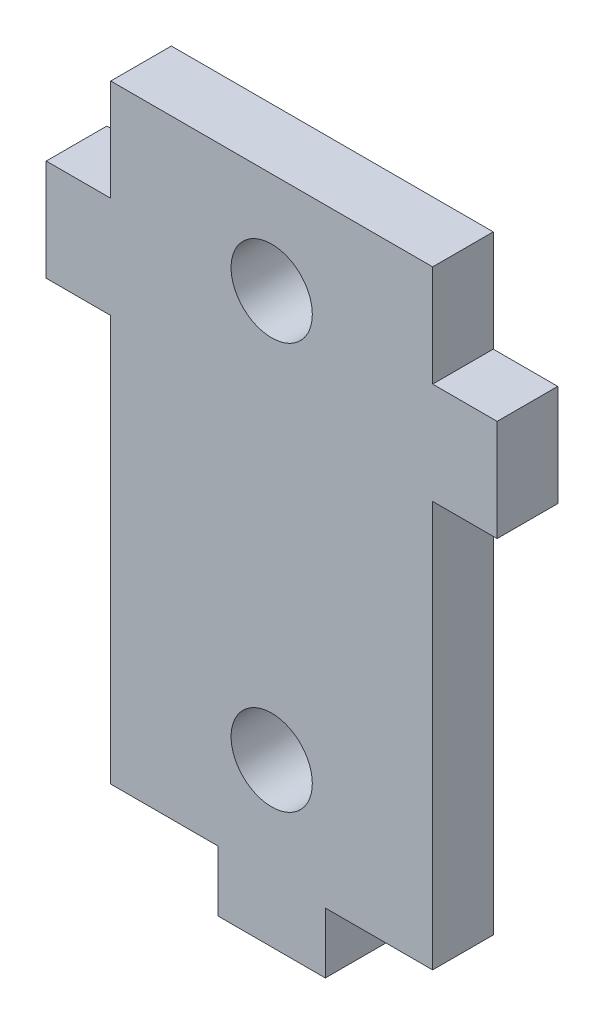
ISO-10303-21;
HEADER;
FILE_DESCRIPTION(('STEP AP214'),'2;1');
FILE_NAME('part.step','',(''),(''),'','','');
FILE_SCHEMA(('AUTOMOTIVE_DESIGN { 1 0 10303 214 1 1 1 1 }'));
ENDSEC;
DATA;
#1=APPLICATION_CONTEXT('core data for automotive mechanical design processes');
#2=APPLICATION_PROTOCOL_DEFINITION('international standard','automotive_design',2000,#1);
#3=PRODUCT_CONTEXT('',#1,'mechanical');
#4=PRODUCT('Part','Part','',(#3));
#5=PRODUCT_RELATED_PRODUCT_CATEGORY('part','',(#4));
#6=PRODUCT_DEFINITION_FORMATION('','',#4);
#7=PRODUCT_DEFINITION_CONTEXT('part definition',#1,'design');
#8=PRODUCT_DEFINITION('design','',#6,#7);
#9=PRODUCT_DEFINITION_SHAPE('','',#8);
#10=(LENGTH_UNIT() NAMED_UNIT(*) SI_UNIT(.MILLI.,.METRE.));
#11=(NAMED_UNIT(*) PLANE_ANGLE_UNIT() SI_UNIT($,.RADIAN.));
#12=(NAMED_UNIT(*) SI_UNIT($,.STERADIAN.) SOLID_ANGLE_UNIT());
#13=UNCERTAINTY_MEASURE_WITH_UNIT(LENGTH_MEASURE(1.E-05),#10,'distance_accuracy_value','');
#14=(GEOMETRIC_REPRESENTATION_CONTEXT(3) GLOBAL_UNCERTAINTY_ASSIGNED_CONTEXT((#13)) GLOBAL_UNIT_ASSIGNED_CONTEXT((#10,
#11,#12)) REPRESENTATION_CONTEXT('',''));
#15=CARTESIAN_POINT('',(0.,0.,0.));
#16=DIRECTION('',(0.,0.,1.));
#17=DIRECTION('',(1.,0.,0.));
#18=AXIS2_PLACEMENT_3D('',#15,#16,#17);
#19=CARTESIAN_POINT('',(-2.21666666666667,49.9590392592217,5.969));
#20=DIRECTION('',(0.,1.,0.));
#21=DIRECTION('',(0.,0.,1.));
#22=AXIS2_PLACEMENT_3D('',#19,#20,#21);
#23=PLANE('',#22);
#24=DIRECTION('',(1.,0.,0.));
#25=VECTOR('',#24,1.);
#26=CARTESIAN_POINT('',(-2.21666666666667,49.9590392592217,5.969));
#27=LINE('',#26,#25);
#28=CARTESIAN_POINT('',(-16.9166666666667,49.9590392592217,5.969));
#29=VERTEX_POINT('',#28);
#30=CARTESIAN_POINT('',(-10.5666666666667,49.9590392592217,5.969));
#31=VERTEX_POINT('',#30);
#32=EDGE_CURVE('E163',#29,#31,#27,.T.);
#33=ORIENTED_EDGE('',*,*,#32,.T.);
#34=DIRECTION('',(0.,0.,1.));
#35=VECTOR('',#34,1.);
#36=CARTESIAN_POINT('',(-10.5666666666667,49.9590392592217,-40.8221425028136));
#37=LINE('',#36,#35);
#38=CARTESIAN_POINT('',(-10.5666666666667,49.9590392592217,0.));
#39=VERTEX_POINT('',#38);
#40=EDGE_CURVE('E150',#39,#31,#37,.T.);
#41=ORIENTED_EDGE('',*,*,#40,.F.);
#42=DIRECTION('',(1.,0.,0.));
#43=VECTOR('',#42,1.);
#44=CARTESIAN_POINT('',(-2.21666666666667,49.9590392592217,0.));
#45=LINE('',#44,#43);
#46=CARTESIAN_POINT('',(-16.9166666666667,49.9590392592217,0.));
#47=VERTEX_POINT('',#46);
#48=EDGE_CURVE('E161',#47,#39,#45,.T.);
#49=ORIENTED_EDGE('',*,*,#48,.F.);
#50=DIRECTION('',(0.,0.,-1.));
#51=VECTOR('',#50,1.);
#52=CARTESIAN_POINT('',(-16.9166666666667,49.9590392592217,5.969));
#53=LINE('',#52,#51);
#54=EDGE_CURVE('E178',#29,#47,#53,.T.);
#55=ORIENTED_EDGE('',*,*,#54,.F.);
#56=EDGE_LOOP('',(#33,#41,#49,#55));
#57=FACE_BOUND('',#56,.T.);
#58=ADVANCED_FACE('F34',(#57),#23,.T.);
#59=CARTESIAN_POINT('',(-2.21666666666667,39.9590392592217,5.969));
#60=DIRECTION('',(0.,-1.,0.));
#61=DIRECTION('',(0.,0.,-1.));
#62=AXIS2_PLACEMENT_3D('',#59,#60,#61);
#63=PLANE('',#62);
#64=DIRECTION('',(-1.,0.,0.));
#65=VECTOR('',#64,1.);
#66=CARTESIAN_POINT('',(-2.21666666666667,39.9590392592217,0.));
#67=LINE('',#66,#65);
#68=CARTESIAN_POINT('',(-10.5666666666667,39.9590392592217,0.));
#69=VERTEX_POINT('',#68);
#70=CARTESIAN_POINT('',(-16.9166666666667,39.9590392592217,0.));
#71=VERTEX_POINT('',#70);
#72=EDGE_CURVE('E174',#69,#71,#67,.T.);
#73=ORIENTED_EDGE('',*,*,#72,.F.);
#74=DIRECTION('',(0.,0.,1.));
#75=VECTOR('',#74,1.);
#76=CARTESIAN_POINT('',(-10.5666666666667,39.9590392592217,-40.8221425028136));
#77=LINE('',#76,#75);
#78=CARTESIAN_POINT('',(-10.5666666666667,39.9590392592217,5.969));
#79=VERTEX_POINT('',#78);
#80=EDGE_CURVE('E271',#69,#79,#77,.T.);
#81=ORIENTED_EDGE('',*,*,#80,.T.);
#82=DIRECTION('',(-1.,0.,0.));
#83=VECTOR('',#82,1.);
#84=CARTESIAN_POINT('',(-2.21666666666667,39.9590392592217,5.969));
#85=LINE('',#84,#83);
#86=CARTESIAN_POINT('',(-16.9166666666667,39.9590392592217,5.969));
#87=VERTEX_POINT('',#86);
#88=EDGE_CURVE('E170',#79,#87,#85,.T.);
#89=ORIENTED_EDGE('',*,*,#88,.T.);
#90=DIRECTION('',(0.,0.,-1.));
#91=VECTOR('',#90,1.);
#92=CARTESIAN_POINT('',(-16.9166666666667,39.9590392592217,5.969));
#93=LINE('',#92,#91);
#94=EDGE_CURVE('E181',#87,#71,#93,.T.);
#95=ORIENTED_EDGE('',*,*,#94,.T.);
#96=EDGE_LOOP('',(#73,#81,#89,#95));
#97=FACE_BOUND('',#96,.T.);
#98=ADVANCED_FACE('F314',(#97),#63,.T.);
#99=CARTESIAN_POINT('',(12.7833333333333,39.9590392592217,5.969));
#100=DIRECTION('',(0.,-1.,0.));
#101=DIRECTION('',(0.,0.,-1.));
#102=AXIS2_PLACEMENT_3D('',#99,#100,#101);
#103=PLANE('',#102);
#104=DIRECTION('',(-1.,0.,0.));
#105=VECTOR('',#104,1.);
#106=CARTESIAN_POINT('',(12.7833333333333,39.9590392592217,5.969));
#107=LINE('',#106,#105);
#108=CARTESIAN_POINT('',(27.4833333333333,39.9590392592217,5.969));
#109=VERTEX_POINT('',#108);
#110=CARTESIAN_POINT('',(21.1333333333333,39.9590392592217,5.969));
#111=VERTEX_POINT('',#110);
#112=EDGE_CURVE('E297',#109,#111,#107,.T.);
#113=ORIENTED_EDGE('',*,*,#112,.T.);
#114=DIRECTION('',(0.,0.,1.));
#115=VECTOR('',#114,1.);
#116=CARTESIAN_POINT('',(21.1333333333333,39.9590392592217,-40.8221425028136));
#117=LINE('',#116,#115);
#118=CARTESIAN_POINT('',(21.1333333333333,39.9590392592217,0.));
#119=VERTEX_POINT('',#118);
#120=EDGE_CURVE('E276',#119,#111,#117,.T.);
#121=ORIENTED_EDGE('',*,*,#120,.F.);
#122=DIRECTION('',(-1.,0.,0.));
#123=VECTOR('',#122,1.);
#124=CARTESIAN_POINT('',(12.7833333333333,39.9590392592217,0.));
#125=LINE('',#124,#123);
#126=CARTESIAN_POINT('',(27.4833333333333,39.9590392592217,0.));
#127=VERTEX_POINT('',#126);
#128=EDGE_CURVE('E294',#127,#119,#125,.T.);
#129=ORIENTED_EDGE('',*,*,#128,.F.);
#130=DIRECTION('',(0.,0.,-1.));
#131=VECTOR('',#130,1.);
#132=CARTESIAN_POINT('',(27.4833333333333,39.9590392592217,5.969));
#133=LINE('',#132,#131);
#134=EDGE_CURVE('E305',#109,#127,#133,.T.);
#135=ORIENTED_EDGE('',*,*,#134,.F.);
#136=EDGE_LOOP('',(#113,#121,#129,#135));
#137=FACE_BOUND('',#136,.T.);
#138=ADVANCED_FACE('F334',(#137),#103,.T.);
#139=CARTESIAN_POINT('',(12.7833333333333,49.9590392592217,5.969));
#140=DIRECTION('',(0.,1.,0.));
#141=DIRECTION('',(0.,0.,1.));
#142=AXIS2_PLACEMENT_3D('',#139,#140,#141);
#143=PLANE('',#142);
#144=DIRECTION('',(1.,0.,0.));
#145=VECTOR('',#144,1.);
#146=CARTESIAN_POINT('',(12.7833333333333,49.9590392592217,0.));
#147=LINE('',#146,#145);
#148=CARTESIAN_POINT('',(21.1333333333333,49.9590392592217,0.));
#149=VERTEX_POINT('',#148);
#150=CARTESIAN_POINT('',(27.4833333333333,49.9590392592217,0.));
#151=VERTEX_POINT('',#150);
#152=EDGE_CURVE('E286',#149,#151,#147,.T.);
#153=ORIENTED_EDGE('',*,*,#152,.F.);
#154=DIRECTION('',(0.,0.,1.));
#155=VECTOR('',#154,1.);
#156=CARTESIAN_POINT('',(21.1333333333333,49.9590392592217,-40.8221425028136));
#157=LINE('',#156,#155);
#158=CARTESIAN_POINT('',(21.1333333333333,49.9590392592217,5.969));
#159=VERTEX_POINT('',#158);
#160=EDGE_CURVE('E284',#149,#159,#157,.T.);
#161=ORIENTED_EDGE('',*,*,#160,.T.);
#162=DIRECTION('',(1.,0.,0.));
#163=VECTOR('',#162,1.);
#164=CARTESIAN_POINT('',(12.7833333333333,49.9590392592217,5.969));
#165=LINE('',#164,#163);
#166=CARTESIAN_POINT('',(27.4833333333333,49.9590392592217,5.969));
#167=VERTEX_POINT('',#166);
#168=EDGE_CURVE('E291',#159,#167,#165,.T.);
#169=ORIENTED_EDGE('',*,*,#168,.T.);
#170=DIRECTION('',(0.,0.,-1.));
#171=VECTOR('',#170,1.);
#172=CARTESIAN_POINT('',(27.4833333333333,49.9590392592217,5.969));
#173=LINE('',#172,#171);
#174=EDGE_CURVE('E299',#167,#151,#173,.T.);
#175=ORIENTED_EDGE('',*,*,#174,.T.);
#176=EDGE_LOOP('',(#153,#161,#169,#175));
#177=FACE_BOUND('',#176,.T.);
#178=ADVANCED_FACE('F327',(#177),#143,.T.);
#179=CARTESIAN_POINT('',(0.,0.,5.969));
#180=DIRECTION('',(0.,0.,-1.));
#181=DIRECTION('',(-1.,0.,0.));
#182=AXIS2_PLACEMENT_3D('',#179,#180,#181);
#183=PLANE('',#182);
#184=DIRECTION('',(0.,1.,0.));
#185=VECTOR('',#184,1.);
#186=CARTESIAN_POINT('',(-10.5666666666667,0.,5.969));
#187=LINE('',#186,#185);
#188=CARTESIAN_POINT('',(-10.5666666666667,0.,5.969));
#189=VERTEX_POINT('',#188);
#190=EDGE_CURVE('E155',#189,#79,#187,.T.);
#191=ORIENTED_EDGE('',*,*,#190,.F.);
#192=DIRECTION('',(1.,0.,0.));
#193=VECTOR('',#192,1.);
#194=CARTESIAN_POINT('',(-10.5666666666667,0.,5.969));
#195=LINE('',#194,#193);
#196=CARTESIAN_POINT('',(0.,0.,5.969));
#197=VERTEX_POINT('',#196);
#198=EDGE_CURVE('E209',#189,#197,#195,.T.);
#199=ORIENTED_EDGE('',*,*,#198,.T.);
#200=DIRECTION('',(0.,-1.,0.));
#201=VECTOR('',#200,1.);
#202=CARTESIAN_POINT('',(0.,-5.969,5.969));
#203=LINE('',#202,#201);
#204=CARTESIAN_POINT('',(0.,-5.969,5.969));
#205=VERTEX_POINT('',#204);
#206=EDGE_CURVE('E196',#197,#205,#203,.T.);
#207=ORIENTED_EDGE('',*,*,#206,.T.);
#208=DIRECTION('',(1.,0.,0.));
#209=VECTOR('',#208,1.);
#210=CARTESIAN_POINT('',(10.5666666666667,-5.969,5.969));
#211=LINE('',#210,#209);
#212=CARTESIAN_POINT('',(10.5666666666667,-5.969,5.969));
#213=VERTEX_POINT('',#212);
#214=EDGE_CURVE('E199',#205,#213,#211,.T.);
#215=ORIENTED_EDGE('',*,*,#214,.T.);
#216=DIRECTION('',(0.,1.,0.));
#217=VECTOR('',#216,1.);
#218=CARTESIAN_POINT('',(10.5666666666667,0.,5.969));
#219=LINE('',#218,#217);
#220=CARTESIAN_POINT('',(10.5666666666667,0.,5.969));
#221=VERTEX_POINT('',#220);
#222=EDGE_CURVE('E202',#213,#221,#219,.T.);
#223=ORIENTED_EDGE('',*,*,#222,.T.);
#224=DIRECTION('',(1.,0.,0.));
#225=VECTOR('',#224,1.);
#226=CARTESIAN_POINT('',(21.1333333333333,0.,5.969));
#227=LINE('',#226,#225);
#228=CARTESIAN_POINT('',(21.1333333333333,0.,5.969));
#229=VERTEX_POINT('',#228);
#230=EDGE_CURVE('E204',#221,#229,#227,.T.);
#231=ORIENTED_EDGE('',*,*,#230,.T.);
#232=DIRECTION('',(0.,-1.,0.));
#233=VECTOR('',#232,1.);
#234=CARTESIAN_POINT('',(21.1333333333333,0.,5.969));
#235=LINE('',#234,#233);
#236=EDGE_CURVE('E256',#111,#229,#235,.T.);
#237=ORIENTED_EDGE('',*,*,#236,.F.);
#238=ORIENTED_EDGE('',*,*,#112,.F.);
#239=DIRECTION('',(0.,-1.,0.));
#240=VECTOR('',#239,1.);
#241=CARTESIAN_POINT('',(27.4833333333333,49.9590392592217,5.969));
#242=LINE('',#241,#240);
#243=EDGE_CURVE('E293',#167,#109,#242,.T.);
#244=ORIENTED_EDGE('',*,*,#243,.F.);
#245=ORIENTED_EDGE('',*,*,#168,.F.);
#246=DIRECTION('',(0.,-1.,0.));
#247=VECTOR('',#246,1.);
#248=CARTESIAN_POINT('',(21.1333333333333,0.,5.969));
#249=LINE('',#248,#247);
#250=CARTESIAN_POINT('',(21.1333333333333,59.9590392592217,5.969));
#251=VERTEX_POINT('',#250);
#252=EDGE_CURVE('E282',#251,#159,#249,.T.);
#253=ORIENTED_EDGE('',*,*,#252,.F.);
#254=DIRECTION('',(-1.,0.,0.));
#255=VECTOR('',#254,1.);
#256=CARTESIAN_POINT('',(-2.21666666666667,59.9590392592217,5.969));
#257=LINE('',#256,#255);
#258=CARTESIAN_POINT('',(-10.5666666666667,59.9590392592217,5.969));
#259=VERTEX_POINT('',#258);
#260=EDGE_CURVE('E207',#251,#259,#257,.T.);
#261=ORIENTED_EDGE('',*,*,#260,.T.);
#262=DIRECTION('',(0.,1.,0.));
#263=VECTOR('',#262,1.);
#264=CARTESIAN_POINT('',(-10.5666666666667,0.,5.969));
#265=LINE('',#264,#263);
#266=EDGE_CURVE('E156',#31,#259,#265,.T.);
#267=ORIENTED_EDGE('',*,*,#266,.F.);
#268=ORIENTED_EDGE('',*,*,#32,.F.);
#269=DIRECTION('',(0.,1.,0.));
#270=VECTOR('',#269,1.);
#271=CARTESIAN_POINT('',(-16.9166666666667,49.9590392592217,5.969));
#272=LINE('',#271,#270);
#273=EDGE_CURVE('E172',#87,#29,#272,.T.);
#274=ORIENTED_EDGE('',*,*,#273,.F.);
#275=ORIENTED_EDGE('',*,*,#88,.F.);
#276=EDGE_LOOP('',(#191,#199,#207,#215,#223,#231,#237,#238,#244,#245,#253,#261,#267,#268,#274,#275));
#277=FACE_BOUND('',#276,.T.);
#278=CARTESIAN_POINT('',(5.28333333333333,49.9795196296108,5.969));
#279=DIRECTION('',(0.,0.,1.));
#280=DIRECTION('',(1.,0.,0.));
#281=AXIS2_PLACEMENT_3D('',#278,#279,#280);
#282=CIRCLE('',#281,4.);
#283=CARTESIAN_POINT('',(9.28333333333334,49.9795196296108,5.969));
#284=VERTEX_POINT('',#283);
#285=EDGE_CURVE('E190',#284,#284,#282,.T.);
#286=ORIENTED_EDGE('',*,*,#285,.F.);
#287=EDGE_LOOP('',(#286));
#288=FACE_BOUND('',#287,.T.);
#289=CARTESIAN_POINT('',(5.28333333333333,9.97951962961084,5.969));
#290=DIRECTION('',(0.,0.,1.));
#291=DIRECTION('',(1.,0.,0.));
#292=AXIS2_PLACEMENT_3D('',#289,#290,#291);
#293=CIRCLE('',#292,4.);
#294=CARTESIAN_POINT('',(9.28333333333333,9.97951962961084,5.969));
#295=VERTEX_POINT('',#294);
#296=EDGE_CURVE('E184',#295,#295,#293,.T.);
#297=ORIENTED_EDGE('',*,*,#296,.F.);
#298=EDGE_LOOP('',(#297));
#299=FACE_BOUND('',#298,.T.);
#300=ADVANCED_FACE('F253',(#277,#288,#299),#183,.F.);
#301=CARTESIAN_POINT('',(0.,0.,0.));
#302=DIRECTION('',(0.,0.,-1.));
#303=DIRECTION('',(-1.,0.,0.));
#304=AXIS2_PLACEMENT_3D('',#301,#302,#303);
#305=PLANE('',#304);
#306=DIRECTION('',(1.,0.,0.));
#307=VECTOR('',#306,1.);
#308=CARTESIAN_POINT('',(-10.5666666666667,0.,0.));
#309=LINE('',#308,#307);
#310=CARTESIAN_POINT('',(-10.5666666666667,0.,0.));
#311=VERTEX_POINT('',#310);
#312=CARTESIAN_POINT('',(0.,0.,0.));
#313=VERTEX_POINT('',#312);
#314=EDGE_CURVE('E200',#311,#313,#309,.T.);
#315=ORIENTED_EDGE('',*,*,#314,.F.);
#316=DIRECTION('',(0.,1.,0.));
#317=VECTOR('',#316,1.);
#318=CARTESIAN_POINT('',(-10.5666666666667,0.,0.));
#319=LINE('',#318,#317);
#320=EDGE_CURVE('E49',#311,#69,#319,.T.);
#321=ORIENTED_EDGE('',*,*,#320,.T.);
#322=ORIENTED_EDGE('',*,*,#72,.T.);
#323=DIRECTION('',(0.,1.,0.));
#324=VECTOR('',#323,1.);
#325=CARTESIAN_POINT('',(-16.9166666666667,49.9590392592217,0.));
#326=LINE('',#325,#324);
#327=EDGE_CURVE('E169',#71,#47,#326,.T.);
#328=ORIENTED_EDGE('',*,*,#327,.T.);
#329=ORIENTED_EDGE('',*,*,#48,.T.);
#330=DIRECTION('',(0.,1.,0.));
#331=VECTOR('',#330,1.);
#332=CARTESIAN_POINT('',(-10.5666666666667,0.,0.));
#333=LINE('',#332,#331);
#334=CARTESIAN_POINT('',(-10.5666666666667,59.9590392592217,0.));
#335=VERTEX_POINT('',#334);
#336=EDGE_CURVE('E146',#39,#335,#333,.T.);
#337=ORIENTED_EDGE('',*,*,#336,.T.);
#338=DIRECTION('',(-1.,0.,0.));
#339=VECTOR('',#338,1.);
#340=CARTESIAN_POINT('',(-2.21666666666667,59.9590392592217,0.));
#341=LINE('',#340,#339);
#342=CARTESIAN_POINT('',(21.1333333333333,59.9590392592217,0.));
#343=VERTEX_POINT('',#342);
#344=EDGE_CURVE('E221',#343,#335,#341,.T.);
#345=ORIENTED_EDGE('',*,*,#344,.F.);
#346=DIRECTION('',(0.,-1.,0.));
#347=VECTOR('',#346,1.);
#348=CARTESIAN_POINT('',(21.1333333333333,0.,0.));
#349=LINE('',#348,#347);
#350=EDGE_CURVE('E56',#343,#149,#349,.T.);
#351=ORIENTED_EDGE('',*,*,#350,.T.);
#352=ORIENTED_EDGE('',*,*,#152,.T.);
#353=DIRECTION('',(0.,-1.,0.));
#354=VECTOR('',#353,1.);
#355=CARTESIAN_POINT('',(27.4833333333333,49.9590392592217,0.));
#356=LINE('',#355,#354);
#357=EDGE_CURVE('E301',#151,#127,#356,.T.);
#358=ORIENTED_EDGE('',*,*,#357,.T.);
#359=ORIENTED_EDGE('',*,*,#128,.T.);
#360=DIRECTION('',(0.,-1.,0.));
#361=VECTOR('',#360,1.);
#362=CARTESIAN_POINT('',(21.1333333333333,0.,0.));
#363=LINE('',#362,#361);
#364=CARTESIAN_POINT('',(21.1333333333333,0.,0.));
#365=VERTEX_POINT('',#364);
#366=EDGE_CURVE('E245',#119,#365,#363,.T.);
#367=ORIENTED_EDGE('',*,*,#366,.T.);
#368=DIRECTION('',(1.,0.,0.));
#369=VECTOR('',#368,1.);
#370=CARTESIAN_POINT('',(21.1333333333333,0.,0.));
#371=LINE('',#370,#369);
#372=CARTESIAN_POINT('',(10.5666666666667,0.,0.));
#373=VERTEX_POINT('',#372);
#374=EDGE_CURVE('E218',#373,#365,#371,.T.);
#375=ORIENTED_EDGE('',*,*,#374,.F.);
#376=DIRECTION('',(0.,1.,0.));
#377=VECTOR('',#376,1.);
#378=CARTESIAN_POINT('',(10.5666666666667,0.,0.));
#379=LINE('',#378,#377);
#380=CARTESIAN_POINT('',(10.5666666666667,-5.969,0.));
#381=VERTEX_POINT('',#380);
#382=EDGE_CURVE('E216',#381,#373,#379,.T.);
#383=ORIENTED_EDGE('',*,*,#382,.F.);
#384=DIRECTION('',(1.,0.,0.));
#385=VECTOR('',#384,1.);
#386=CARTESIAN_POINT('',(10.5666666666667,-5.969,0.));
#387=LINE('',#386,#385);
#388=CARTESIAN_POINT('',(0.,-5.969,0.));
#389=VERTEX_POINT('',#388);
#390=EDGE_CURVE('E214',#389,#381,#387,.T.);
#391=ORIENTED_EDGE('',*,*,#390,.F.);
#392=DIRECTION('',(0.,-1.,0.));
#393=VECTOR('',#392,1.);
#394=CARTESIAN_POINT('',(0.,-5.969,0.));
#395=LINE('',#394,#393);
#396=EDGE_CURVE('E193',#313,#389,#395,.T.);
#397=ORIENTED_EDGE('',*,*,#396,.F.);
#398=EDGE_LOOP('',(#315,#321,#322,#328,#329,#337,#345,#351,#352,#358,#359,#367,#375,#383,#391,#397));
#399=FACE_BOUND('',#398,.T.);
#400=CARTESIAN_POINT('',(5.28333333333333,49.9795196296108,0.));
#401=DIRECTION('',(0.,0.,1.));
#402=DIRECTION('',(1.,0.,0.));
#403=AXIS2_PLACEMENT_3D('',#400,#401,#402);
#404=CIRCLE('',#403,4.);
#405=CARTESIAN_POINT('',(9.28333333333334,49.9795196296108,0.));
#406=VERTEX_POINT('',#405);
#407=EDGE_CURVE('E187',#406,#406,#404,.T.);
#408=ORIENTED_EDGE('',*,*,#407,.T.);
#409=EDGE_LOOP('',(#408));
#410=FACE_BOUND('',#409,.T.);
#411=CARTESIAN_POINT('',(5.28333333333333,9.97951962961084,0.));
#412=DIRECTION('',(0.,0.,1.));
#413=DIRECTION('',(1.,0.,0.));
#414=AXIS2_PLACEMENT_3D('',#411,#412,#413);
#415=CIRCLE('',#414,4.);
#416=CARTESIAN_POINT('',(9.28333333333333,9.97951962961084,0.));
#417=VERTEX_POINT('',#416);
#418=EDGE_CURVE('E180',#417,#417,#415,.T.);
#419=ORIENTED_EDGE('',*,*,#418,.T.);
#420=EDGE_LOOP('',(#419));
#421=FACE_BOUND('',#420,.T.);
#422=ADVANCED_FACE('F166',(#399,#410,#421),#305,.T.);
#423=CARTESIAN_POINT('',(0.,-5.969,5.969));
#424=DIRECTION('',(1.,0.,0.));
#425=DIRECTION('',(0.,0.,-1.));
#426=AXIS2_PLACEMENT_3D('',#423,#424,#425);
#427=PLANE('',#426);
#428=ORIENTED_EDGE('',*,*,#396,.T.);
#429=DIRECTION('',(0.,0.,-1.));
#430=VECTOR('',#429,1.);
#431=CARTESIAN_POINT('',(0.,-5.969,5.969));
#432=LINE('',#431,#430);
#433=EDGE_CURVE('E11',#205,#389,#432,.T.);
#434=ORIENTED_EDGE('',*,*,#433,.F.);
#435=ORIENTED_EDGE('',*,*,#206,.F.);
#436=DIRECTION('',(0.,0.,-1.));
#437=VECTOR('',#436,1.);
#438=CARTESIAN_POINT('',(0.,0.,5.969));
#439=LINE('',#438,#437);
#440=EDGE_CURVE('E211',#197,#313,#439,.T.);
#441=ORIENTED_EDGE('',*,*,#440,.T.);
#442=EDGE_LOOP('',(#428,#434,#435,#441));
#443=FACE_BOUND('',#442,.T.);
#444=ADVANCED_FACE('F36',(#443),#427,.F.);
#445=CARTESIAN_POINT('',(10.5666666666667,-5.969,5.969));
#446=DIRECTION('',(0.,1.,0.));
#447=DIRECTION('',(0.,0.,1.));
#448=AXIS2_PLACEMENT_3D('',#445,#446,#447);
#449=PLANE('',#448);
#450=ORIENTED_EDGE('',*,*,#390,.T.);
#451=DIRECTION('',(0.,0.,-1.));
#452=VECTOR('',#451,1.);
#453=CARTESIAN_POINT('',(10.5666666666667,-5.969,5.969));
#454=LINE('',#453,#452);
#455=EDGE_CURVE('E42',#213,#381,#454,.T.);
#456=ORIENTED_EDGE('',*,*,#455,.F.);
#457=ORIENTED_EDGE('',*,*,#214,.F.);
#458=ORIENTED_EDGE('',*,*,#433,.T.);
#459=EDGE_LOOP('',(#450,#456,#457,#458));
#460=FACE_BOUND('',#459,.T.);
#461=ADVANCED_FACE('F260',(#460),#449,.F.);
#462=CARTESIAN_POINT('',(10.5666666666667,0.,5.969));
#463=DIRECTION('',(-1.,0.,0.));
#464=DIRECTION('',(0.,0.,1.));
#465=AXIS2_PLACEMENT_3D('',#462,#463,#464);
#466=PLANE('',#465);
#467=ORIENTED_EDGE('',*,*,#382,.T.);
#468=DIRECTION('',(0.,0.,-1.));
#469=VECTOR('',#468,1.);
#470=CARTESIAN_POINT('',(10.5666666666667,0.,5.969));
#471=LINE('',#470,#469);
#472=EDGE_CURVE('E231',#221,#373,#471,.T.);
#473=ORIENTED_EDGE('',*,*,#472,.F.);
#474=ORIENTED_EDGE('',*,*,#222,.F.);
#475=ORIENTED_EDGE('',*,*,#455,.T.);
#476=EDGE_LOOP('',(#467,#473,#474,#475));
#477=FACE_BOUND('',#476,.T.);
#478=ADVANCED_FACE('F238',(#477),#466,.F.);
#479=CARTESIAN_POINT('',(21.1333333333333,0.,5.969));
#480=DIRECTION('',(0.,1.,0.));
#481=DIRECTION('',(0.,0.,1.));
#482=AXIS2_PLACEMENT_3D('',#479,#480,#481);
#483=PLANE('',#482);
#484=ORIENTED_EDGE('',*,*,#374,.T.);
#485=DIRECTION('',(0.,0.,-1.));
#486=VECTOR('',#485,1.);
#487=CARTESIAN_POINT('',(21.1333333333333,0.,5.969));
#488=LINE('',#487,#486);
#489=EDGE_CURVE('E229',#229,#365,#488,.T.);
#490=ORIENTED_EDGE('',*,*,#489,.F.);
#491=ORIENTED_EDGE('',*,*,#230,.F.);
#492=ORIENTED_EDGE('',*,*,#472,.T.);
#493=EDGE_LOOP('',(#484,#490,#491,#492));
#494=FACE_BOUND('',#493,.T.);
#495=ADVANCED_FACE('F248',(#494),#483,.F.);
#496=CARTESIAN_POINT('',(-2.21666666666667,59.9590392592217,5.969));
#497=DIRECTION('',(0.,-1.,0.));
#498=DIRECTION('',(0.,0.,-1.));
#499=AXIS2_PLACEMENT_3D('',#496,#497,#498);
#500=PLANE('',#499);
#501=ORIENTED_EDGE('',*,*,#344,.T.);
#502=DIRECTION('',(0.,0.,1.));
#503=VECTOR('',#502,1.);
#504=CARTESIAN_POINT('',(-10.5666666666667,59.9590392592217,-40.8221425028136));
#505=LINE('',#504,#503);
#506=EDGE_CURVE('E153',#335,#259,#505,.T.);
#507=ORIENTED_EDGE('',*,*,#506,.T.);
#508=ORIENTED_EDGE('',*,*,#260,.F.);
#509=DIRECTION('',(0.,0.,1.));
#510=VECTOR('',#509,1.);
#511=CARTESIAN_POINT('',(21.1333333333333,59.9590392592217,-40.8221425028136));
#512=LINE('',#511,#510);
#513=EDGE_CURVE('E280',#343,#251,#512,.T.);
#514=ORIENTED_EDGE('',*,*,#513,.F.);
#515=EDGE_LOOP('',(#501,#507,#508,#514));
#516=FACE_BOUND('',#515,.T.);
#517=ADVANCED_FACE('F322',(#516),#500,.F.);
#518=CARTESIAN_POINT('',(-10.5666666666667,0.,5.969));
#519=DIRECTION('',(0.,1.,0.));
#520=DIRECTION('',(0.,0.,1.));
#521=AXIS2_PLACEMENT_3D('',#518,#519,#520);
#522=PLANE('',#521);
#523=ORIENTED_EDGE('',*,*,#314,.T.);
#524=ORIENTED_EDGE('',*,*,#440,.F.);
#525=ORIENTED_EDGE('',*,*,#198,.F.);
#526=DIRECTION('',(0.,0.,-1.));
#527=VECTOR('',#526,1.);
#528=CARTESIAN_POINT('',(-10.5666666666667,0.,5.969));
#529=LINE('',#528,#527);
#530=EDGE_CURVE('E226',#189,#311,#529,.T.);
#531=ORIENTED_EDGE('',*,*,#530,.T.);
#532=EDGE_LOOP('',(#523,#524,#525,#531));
#533=FACE_BOUND('',#532,.T.);
#534=ADVANCED_FACE('F264',(#533),#522,.F.);
#535=CARTESIAN_POINT('',(5.28333333333333,49.9795196296108,5.969));
#536=DIRECTION('',(0.,0.,-1.));
#537=DIRECTION('',(-1.,0.,0.));
#538=AXIS2_PLACEMENT_3D('',#535,#536,#537);
#539=CYLINDRICAL_SURFACE('',#538,4.);
#540=ORIENTED_EDGE('',*,*,#285,.T.);
#541=EDGE_LOOP('',(#540));
#542=FACE_BOUND('',#541,.T.);
#543=ORIENTED_EDGE('',*,*,#407,.F.);
#544=EDGE_LOOP('',(#543));
#545=FACE_BOUND('',#544,.T.);
#546=ADVANCED_FACE('F360',(#542,#545),#539,.F.);
#547=CARTESIAN_POINT('',(5.28333333333333,9.97951962961084,5.969));
#548=DIRECTION('',(0.,0.,-1.));
#549=DIRECTION('',(-1.,0.,0.));
#550=AXIS2_PLACEMENT_3D('',#547,#548,#549);
#551=CYLINDRICAL_SURFACE('',#550,4.);
#552=ORIENTED_EDGE('',*,*,#296,.T.);
#553=EDGE_LOOP('',(#552));
#554=FACE_BOUND('',#553,.T.);
#555=ORIENTED_EDGE('',*,*,#418,.F.);
#556=EDGE_LOOP('',(#555));
#557=FACE_BOUND('',#556,.T.);
#558=ADVANCED_FACE('F356',(#554,#557),#551,.F.);
#559=CARTESIAN_POINT('',(-16.9166666666667,49.9590392592217,5.969));
#560=DIRECTION('',(-1.,0.,0.));
#561=DIRECTION('',(0.,-1.,0.));
#562=AXIS2_PLACEMENT_3D('',#559,#560,#561);
#563=PLANE('',#562);
#564=ORIENTED_EDGE('',*,*,#327,.F.);
#565=ORIENTED_EDGE('',*,*,#94,.F.);
#566=ORIENTED_EDGE('',*,*,#273,.T.);
#567=ORIENTED_EDGE('',*,*,#54,.T.);
#568=EDGE_LOOP('',(#564,#565,#566,#567));
#569=FACE_BOUND('',#568,.T.);
#570=ADVANCED_FACE('F316',(#569),#563,.T.);
#571=CARTESIAN_POINT('',(27.4833333333333,49.9590392592217,5.969));
#572=DIRECTION('',(1.,0.,0.));
#573=DIRECTION('',(0.,1.,0.));
#574=AXIS2_PLACEMENT_3D('',#571,#572,#573);
#575=PLANE('',#574);
#576=ORIENTED_EDGE('',*,*,#357,.F.);
#577=ORIENTED_EDGE('',*,*,#174,.F.);
#578=ORIENTED_EDGE('',*,*,#243,.T.);
#579=ORIENTED_EDGE('',*,*,#134,.T.);
#580=EDGE_LOOP('',(#576,#577,#578,#579));
#581=FACE_BOUND('',#580,.T.);
#582=ADVANCED_FACE('F344',(#581),#575,.T.);
#583=CARTESIAN_POINT('',(21.1333333333333,0.,-40.8221425028136));
#584=DIRECTION('',(-1.,0.,0.));
#585=DIRECTION('',(0.,-1.,0.));
#586=AXIS2_PLACEMENT_3D('',#583,#584,#585);
#587=PLANE('',#586);
#588=ORIENTED_EDGE('',*,*,#350,.F.);
#589=ORIENTED_EDGE('',*,*,#513,.T.);
#590=ORIENTED_EDGE('',*,*,#252,.T.);
#591=ORIENTED_EDGE('',*,*,#160,.F.);
#592=EDGE_LOOP('',(#588,#589,#590,#591));
#593=FACE_BOUND('',#592,.T.);
#594=ADVANCED_FACE('F324',(#593),#587,.F.);
#595=CARTESIAN_POINT('',(21.1333333333333,0.,-40.8221425028136));
#596=DIRECTION('',(-1.,0.,0.));
#597=DIRECTION('',(0.,-1.,0.));
#598=AXIS2_PLACEMENT_3D('',#595,#596,#597);
#599=PLANE('',#598);
#600=ORIENTED_EDGE('',*,*,#366,.F.);
#601=ORIENTED_EDGE('',*,*,#120,.T.);
#602=ORIENTED_EDGE('',*,*,#236,.T.);
#603=ORIENTED_EDGE('',*,*,#489,.T.);
#604=EDGE_LOOP('',(#600,#601,#602,#603));
#605=FACE_BOUND('',#604,.T.);
#606=ADVANCED_FACE('F336',(#605),#599,.F.);
#607=CARTESIAN_POINT('',(-10.5666666666667,0.,-40.8221425028136));
#608=DIRECTION('',(1.,0.,0.));
#609=DIRECTION('',(0.,0.,-1.));
#610=AXIS2_PLACEMENT_3D('',#607,#608,#609);
#611=PLANE('',#610);
#612=ORIENTED_EDGE('',*,*,#320,.F.);
#613=ORIENTED_EDGE('',*,*,#530,.F.);
#614=ORIENTED_EDGE('',*,*,#190,.T.);
#615=ORIENTED_EDGE('',*,*,#80,.F.);
#616=EDGE_LOOP('',(#612,#613,#614,#615));
#617=FACE_BOUND('',#616,.T.);
#618=ADVANCED_FACE('F267',(#617),#611,.F.);
#619=CARTESIAN_POINT('',(-10.5666666666667,0.,-40.8221425028136));
#620=DIRECTION('',(1.,0.,0.));
#621=DIRECTION('',(0.,0.,-1.));
#622=AXIS2_PLACEMENT_3D('',#619,#620,#621);
#623=PLANE('',#622);
#624=ORIENTED_EDGE('',*,*,#336,.F.);
#625=ORIENTED_EDGE('',*,*,#40,.T.);
#626=ORIENTED_EDGE('',*,*,#266,.T.);
#627=ORIENTED_EDGE('',*,*,#506,.F.);
#628=EDGE_LOOP('',(#624,#625,#626,#627));
#629=FACE_BOUND('',#628,.T.);
#630=ADVANCED_FACE('F148',(#629),#623,.F.);
#631=CLOSED_SHELL('',(#58,#98,#138,#178,#300,#422,#444,#461,#478,#495,#517,#534,#546,#558,#570,
#582,#594,#606,#618,#630));
#632=MANIFOLD_SOLID_BREP('B2',#631);
#633=ADVANCED_BREP_SHAPE_REPRESENTATION('',(#18,#632),#14);
#634=SHAPE_DEFINITION_REPRESENTATION(#9,#633);
ENDSEC;
END-ISO-10303-21;
